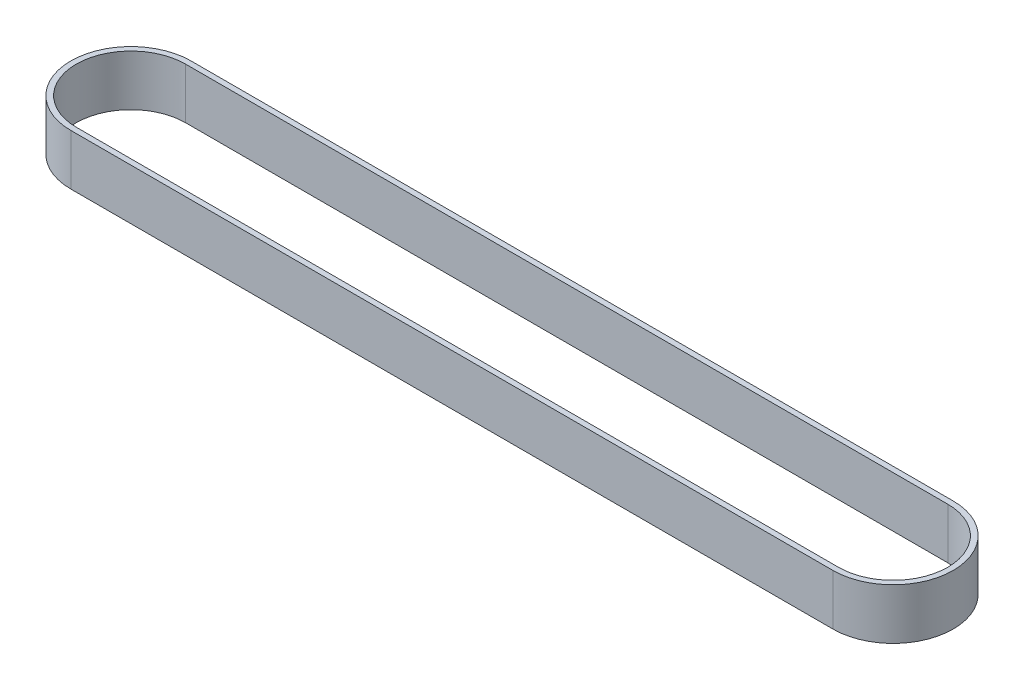
ISO-10303-21;
HEADER;
FILE_DESCRIPTION(('STEP AP214'),'2;1');
FILE_NAME('part.step','',(''),(''),'','','');
FILE_SCHEMA(('AUTOMOTIVE_DESIGN { 1 0 10303 214 1 1 1 1 }'));
ENDSEC;
DATA;
#1=APPLICATION_CONTEXT('core data for automotive mechanical design processes');
#2=APPLICATION_PROTOCOL_DEFINITION('international standard','automotive_design',2000,#1);
#3=PRODUCT_CONTEXT('',#1,'mechanical');
#4=PRODUCT('Part','Part','',(#3));
#5=PRODUCT_RELATED_PRODUCT_CATEGORY('part','',(#4));
#6=PRODUCT_DEFINITION_FORMATION('','',#4);
#7=PRODUCT_DEFINITION_CONTEXT('part definition',#1,'design');
#8=PRODUCT_DEFINITION('design','',#6,#7);
#9=PRODUCT_DEFINITION_SHAPE('','',#8);
#10=(LENGTH_UNIT() NAMED_UNIT(*) SI_UNIT(.MILLI.,.METRE.));
#11=(NAMED_UNIT(*) PLANE_ANGLE_UNIT() SI_UNIT($,.RADIAN.));
#12=(NAMED_UNIT(*) SI_UNIT($,.STERADIAN.) SOLID_ANGLE_UNIT());
#13=UNCERTAINTY_MEASURE_WITH_UNIT(LENGTH_MEASURE(1.E-05),#10,'distance_accuracy_value','');
#14=(GEOMETRIC_REPRESENTATION_CONTEXT(3) GLOBAL_UNCERTAINTY_ASSIGNED_CONTEXT((#13)) GLOBAL_UNIT_ASSIGNED_CONTEXT((#10,
#11,#12)) REPRESENTATION_CONTEXT('',''));
#15=CARTESIAN_POINT('',(0.,0.,0.));
#16=DIRECTION('',(0.,0.,1.));
#17=DIRECTION('',(1.,0.,0.));
#18=AXIS2_PLACEMENT_3D('',#15,#16,#17);
#19=CARTESIAN_POINT('',(0.,9.53,0.));
#20=DIRECTION('',(0.,-1.,0.));
#21=DIRECTION('',(0.,0.,-1.));
#22=AXIS2_PLACEMENT_3D('',#19,#20,#21);
#23=CYLINDRICAL_SURFACE('',#22,11.285);
#24=CARTESIAN_POINT('',(0.,0.,0.));
#25=DIRECTION('',(0.,1.,0.));
#26=DIRECTION('',(0.,0.,1.));
#27=AXIS2_PLACEMENT_3D('',#24,#25,#26);
#28=CIRCLE('',#27,11.285);
#29=CARTESIAN_POINT('',(0.,0.,-11.285));
#30=VERTEX_POINT('',#29);
#31=CARTESIAN_POINT('',(0.,0.,11.285));
#32=VERTEX_POINT('',#31);
#33=EDGE_CURVE('E128',#30,#32,#28,.T.);
#34=ORIENTED_EDGE('',*,*,#33,.T.);
#35=DIRECTION('',(0.,-1.,0.));
#36=VECTOR('',#35,1.);
#37=CARTESIAN_POINT('',(0.,9.53,11.285));
#38=LINE('',#37,#36);
#39=CARTESIAN_POINT('',(0.,9.53,11.285));
#40=VERTEX_POINT('',#39);
#41=EDGE_CURVE('E11',#40,#32,#38,.T.);
#42=ORIENTED_EDGE('',*,*,#41,.F.);
#43=CARTESIAN_POINT('',(0.,9.53,0.));
#44=DIRECTION('',(0.,1.,0.));
#45=DIRECTION('',(0.,0.,1.));
#46=AXIS2_PLACEMENT_3D('',#43,#44,#45);
#47=CIRCLE('',#46,11.285);
#48=CARTESIAN_POINT('',(0.,9.53,-11.285));
#49=VERTEX_POINT('',#48);
#50=EDGE_CURVE('E132',#49,#40,#47,.T.);
#51=ORIENTED_EDGE('',*,*,#50,.F.);
#52=DIRECTION('',(0.,-1.,0.));
#53=VECTOR('',#52,1.);
#54=CARTESIAN_POINT('',(0.,9.53,-11.285));
#55=LINE('',#54,#53);
#56=EDGE_CURVE('E142',#49,#30,#55,.T.);
#57=ORIENTED_EDGE('',*,*,#56,.T.);
#58=EDGE_LOOP('',(#34,#42,#51,#57));
#59=FACE_BOUND('',#58,.T.);
#60=ADVANCED_FACE('F31',(#59),#23,.T.);
#61=CARTESIAN_POINT('',(0.,9.53,11.285));
#62=DIRECTION('',(0.,0.,-1.));
#63=DIRECTION('',(-1.,0.,0.));
#64=AXIS2_PLACEMENT_3D('',#61,#62,#63);
#65=PLANE('',#64);
#66=DIRECTION('',(1.,0.,0.));
#67=VECTOR('',#66,1.);
#68=CARTESIAN_POINT('',(0.,0.,11.285));
#69=LINE('',#68,#67);
#70=CARTESIAN_POINT('',(143.,0.,11.285));
#71=VERTEX_POINT('',#70);
#72=EDGE_CURVE('E145',#32,#71,#69,.T.);
#73=ORIENTED_EDGE('',*,*,#72,.T.);
#74=DIRECTION('',(0.,-1.,0.));
#75=VECTOR('',#74,1.);
#76=CARTESIAN_POINT('',(143.,9.53,11.285));
#77=LINE('',#76,#75);
#78=CARTESIAN_POINT('',(143.,9.53,11.285));
#79=VERTEX_POINT('',#78);
#80=EDGE_CURVE('E38',#79,#71,#77,.T.);
#81=ORIENTED_EDGE('',*,*,#80,.F.);
#82=DIRECTION('',(1.,0.,0.));
#83=VECTOR('',#82,1.);
#84=CARTESIAN_POINT('',(0.,9.53,11.285));
#85=LINE('',#84,#83);
#86=EDGE_CURVE('E135',#40,#79,#85,.T.);
#87=ORIENTED_EDGE('',*,*,#86,.F.);
#88=ORIENTED_EDGE('',*,*,#41,.T.);
#89=EDGE_LOOP('',(#73,#81,#87,#88));
#90=FACE_BOUND('',#89,.T.);
#91=ADVANCED_FACE('F173',(#90),#65,.F.);
#92=CARTESIAN_POINT('',(143.,9.53,0.));
#93=DIRECTION('',(0.,-1.,0.));
#94=DIRECTION('',(0.,0.,-1.));
#95=AXIS2_PLACEMENT_3D('',#92,#93,#94);
#96=CYLINDRICAL_SURFACE('',#95,11.285);
#97=CARTESIAN_POINT('',(143.,0.,0.));
#98=DIRECTION('',(0.,1.,0.));
#99=DIRECTION('',(0.,0.,1.));
#100=AXIS2_PLACEMENT_3D('',#97,#98,#99);
#101=CIRCLE('',#100,11.285);
#102=CARTESIAN_POINT('',(143.,0.,-11.285));
#103=VERTEX_POINT('',#102);
#104=EDGE_CURVE('E147',#71,#103,#101,.T.);
#105=ORIENTED_EDGE('',*,*,#104,.T.);
#106=DIRECTION('',(0.,-1.,0.));
#107=VECTOR('',#106,1.);
#108=CARTESIAN_POINT('',(143.,9.53,-11.285));
#109=LINE('',#108,#107);
#110=CARTESIAN_POINT('',(143.,9.53,-11.285));
#111=VERTEX_POINT('',#110);
#112=EDGE_CURVE('E152',#111,#103,#109,.T.);
#113=ORIENTED_EDGE('',*,*,#112,.F.);
#114=CARTESIAN_POINT('',(143.,9.53,0.));
#115=DIRECTION('',(0.,1.,0.));
#116=DIRECTION('',(0.,0.,1.));
#117=AXIS2_PLACEMENT_3D('',#114,#115,#116);
#118=CIRCLE('',#117,11.285);
#119=EDGE_CURVE('E138',#79,#111,#118,.T.);
#120=ORIENTED_EDGE('',*,*,#119,.F.);
#121=ORIENTED_EDGE('',*,*,#80,.T.);
#122=EDGE_LOOP('',(#105,#113,#120,#121));
#123=FACE_BOUND('',#122,.T.);
#124=ADVANCED_FACE('F159',(#123),#96,.T.);
#125=CARTESIAN_POINT('',(0.,9.53,-11.285));
#126=DIRECTION('',(0.,0.,1.));
#127=DIRECTION('',(1.,0.,0.));
#128=AXIS2_PLACEMENT_3D('',#125,#126,#127);
#129=PLANE('',#128);
#130=DIRECTION('',(-1.,0.,0.));
#131=VECTOR('',#130,1.);
#132=CARTESIAN_POINT('',(0.,0.,-11.285));
#133=LINE('',#132,#131);
#134=EDGE_CURVE('E136',#103,#30,#133,.T.);
#135=ORIENTED_EDGE('',*,*,#134,.T.);
#136=ORIENTED_EDGE('',*,*,#56,.F.);
#137=DIRECTION('',(-1.,0.,0.));
#138=VECTOR('',#137,1.);
#139=CARTESIAN_POINT('',(0.,9.53,-11.285));
#140=LINE('',#139,#138);
#141=EDGE_CURVE('E140',#111,#49,#140,.T.);
#142=ORIENTED_EDGE('',*,*,#141,.F.);
#143=ORIENTED_EDGE('',*,*,#112,.T.);
#144=EDGE_LOOP('',(#135,#136,#142,#143));
#145=FACE_BOUND('',#144,.T.);
#146=ADVANCED_FACE('F166',(#145),#129,.F.);
#147=CARTESIAN_POINT('',(0.,9.53,0.));
#148=DIRECTION('',(0.,1.,0.));
#149=DIRECTION('',(0.,0.,1.));
#150=AXIS2_PLACEMENT_3D('',#147,#148,#149);
#151=PLANE('',#150);
#152=CARTESIAN_POINT('',(0.,9.53,0.));
#153=DIRECTION('',(0.,1.,0.));
#154=DIRECTION('',(0.,0.,1.));
#155=AXIS2_PLACEMENT_3D('',#152,#153,#154);
#156=CIRCLE('',#155,10.255);
#157=CARTESIAN_POINT('',(0.,9.53,-10.255));
#158=VERTEX_POINT('',#157);
#159=CARTESIAN_POINT('',(0.,9.53,10.255));
#160=VERTEX_POINT('',#159);
#161=EDGE_CURVE('E45',#158,#160,#156,.T.);
#162=ORIENTED_EDGE('',*,*,#161,.F.);
#163=DIRECTION('',(-1.,0.,0.));
#164=VECTOR('',#163,1.);
#165=CARTESIAN_POINT('',(0.,9.53,-10.255));
#166=LINE('',#165,#164);
#167=CARTESIAN_POINT('',(143.,9.53,-10.255));
#168=VERTEX_POINT('',#167);
#169=EDGE_CURVE('E113',#168,#158,#166,.T.);
#170=ORIENTED_EDGE('',*,*,#169,.F.);
#171=CARTESIAN_POINT('',(143.,9.53,0.));
#172=DIRECTION('',(0.,1.,0.));
#173=DIRECTION('',(0.,0.,1.));
#174=AXIS2_PLACEMENT_3D('',#171,#172,#173);
#175=CIRCLE('',#174,10.255);
#176=CARTESIAN_POINT('',(143.,9.53,10.255));
#177=VERTEX_POINT('',#176);
#178=EDGE_CURVE('E116',#177,#168,#175,.T.);
#179=ORIENTED_EDGE('',*,*,#178,.F.);
#180=DIRECTION('',(1.,0.,0.));
#181=VECTOR('',#180,1.);
#182=CARTESIAN_POINT('',(0.,9.53,10.255));
#183=LINE('',#182,#181);
#184=EDGE_CURVE('E122',#160,#177,#183,.T.);
#185=ORIENTED_EDGE('',*,*,#184,.F.);
#186=EDGE_LOOP('',(#162,#170,#179,#185));
#187=FACE_BOUND('',#186,.T.);
#188=ORIENTED_EDGE('',*,*,#50,.T.);
#189=ORIENTED_EDGE('',*,*,#86,.T.);
#190=ORIENTED_EDGE('',*,*,#119,.T.);
#191=ORIENTED_EDGE('',*,*,#141,.T.);
#192=EDGE_LOOP('',(#188,#189,#190,#191));
#193=FACE_BOUND('',#192,.T.);
#194=ADVANCED_FACE('F172',(#187,#193),#151,.T.);
#195=CARTESIAN_POINT('',(0.,0.,0.));
#196=DIRECTION('',(0.,1.,0.));
#197=DIRECTION('',(0.,0.,1.));
#198=AXIS2_PLACEMENT_3D('',#195,#196,#197);
#199=PLANE('',#198);
#200=DIRECTION('',(-1.,0.,0.));
#201=VECTOR('',#200,1.);
#202=CARTESIAN_POINT('',(0.,0.,-10.255));
#203=LINE('',#202,#201);
#204=CARTESIAN_POINT('',(143.,0.,-10.255));
#205=VERTEX_POINT('',#204);
#206=CARTESIAN_POINT('',(0.,0.,-10.255));
#207=VERTEX_POINT('',#206);
#208=EDGE_CURVE('E103',#205,#207,#203,.T.);
#209=ORIENTED_EDGE('',*,*,#208,.T.);
#210=CARTESIAN_POINT('',(0.,0.,0.));
#211=DIRECTION('',(0.,1.,0.));
#212=DIRECTION('',(0.,0.,1.));
#213=AXIS2_PLACEMENT_3D('',#210,#211,#212);
#214=CIRCLE('',#213,10.255);
#215=CARTESIAN_POINT('',(0.,0.,10.255));
#216=VERTEX_POINT('',#215);
#217=EDGE_CURVE('E97',#207,#216,#214,.T.);
#218=ORIENTED_EDGE('',*,*,#217,.T.);
#219=DIRECTION('',(1.,0.,0.));
#220=VECTOR('',#219,1.);
#221=CARTESIAN_POINT('',(0.,0.,10.255));
#222=LINE('',#221,#220);
#223=CARTESIAN_POINT('',(143.,0.,10.255));
#224=VERTEX_POINT('',#223);
#225=EDGE_CURVE('E106',#216,#224,#222,.T.);
#226=ORIENTED_EDGE('',*,*,#225,.T.);
#227=CARTESIAN_POINT('',(143.,0.,0.));
#228=DIRECTION('',(0.,1.,0.));
#229=DIRECTION('',(0.,0.,1.));
#230=AXIS2_PLACEMENT_3D('',#227,#228,#229);
#231=CIRCLE('',#230,10.255);
#232=EDGE_CURVE('E53',#224,#205,#231,.T.);
#233=ORIENTED_EDGE('',*,*,#232,.T.);
#234=EDGE_LOOP('',(#209,#218,#226,#233));
#235=FACE_BOUND('',#234,.T.);
#236=ORIENTED_EDGE('',*,*,#33,.F.);
#237=ORIENTED_EDGE('',*,*,#134,.F.);
#238=ORIENTED_EDGE('',*,*,#104,.F.);
#239=ORIENTED_EDGE('',*,*,#72,.F.);
#240=EDGE_LOOP('',(#236,#237,#238,#239));
#241=FACE_BOUND('',#240,.T.);
#242=ADVANCED_FACE('F110',(#235,#241),#199,.F.);
#243=CARTESIAN_POINT('',(0.,0.,0.));
#244=DIRECTION('',(0.,1.,0.));
#245=DIRECTION('',(0.,0.,1.));
#246=AXIS2_PLACEMENT_3D('',#243,#244,#245);
#247=CYLINDRICAL_SURFACE('',#246,10.255);
#248=ORIENTED_EDGE('',*,*,#161,.T.);
#249=DIRECTION('',(0.,1.,0.));
#250=VECTOR('',#249,1.);
#251=CARTESIAN_POINT('',(0.,0.,10.255));
#252=LINE('',#251,#250);
#253=EDGE_CURVE('E93',#216,#160,#252,.T.);
#254=ORIENTED_EDGE('',*,*,#253,.F.);
#255=ORIENTED_EDGE('',*,*,#217,.F.);
#256=DIRECTION('',(0.,1.,0.));
#257=VECTOR('',#256,1.);
#258=CARTESIAN_POINT('',(0.,0.,-10.255));
#259=LINE('',#258,#257);
#260=EDGE_CURVE('E126',#207,#158,#259,.T.);
#261=ORIENTED_EDGE('',*,*,#260,.T.);
#262=EDGE_LOOP('',(#248,#254,#255,#261));
#263=FACE_BOUND('',#262,.T.);
#264=ADVANCED_FACE('F95',(#263),#247,.F.);
#265=CARTESIAN_POINT('',(0.,0.,-10.255));
#266=DIRECTION('',(0.,0.,-1.));
#267=DIRECTION('',(-1.,0.,0.));
#268=AXIS2_PLACEMENT_3D('',#265,#266,#267);
#269=PLANE('',#268);
#270=ORIENTED_EDGE('',*,*,#169,.T.);
#271=ORIENTED_EDGE('',*,*,#260,.F.);
#272=ORIENTED_EDGE('',*,*,#208,.F.);
#273=DIRECTION('',(0.,1.,0.));
#274=VECTOR('',#273,1.);
#275=CARTESIAN_POINT('',(143.,0.,-10.255));
#276=LINE('',#275,#274);
#277=EDGE_CURVE('E129',#205,#168,#276,.T.);
#278=ORIENTED_EDGE('',*,*,#277,.T.);
#279=EDGE_LOOP('',(#270,#271,#272,#278));
#280=FACE_BOUND('',#279,.T.);
#281=ADVANCED_FACE('F190',(#280),#269,.F.);
#282=CARTESIAN_POINT('',(143.,0.,0.));
#283=DIRECTION('',(0.,1.,0.));
#284=DIRECTION('',(0.,0.,1.));
#285=AXIS2_PLACEMENT_3D('',#282,#283,#284);
#286=CYLINDRICAL_SURFACE('',#285,10.255);
#287=ORIENTED_EDGE('',*,*,#178,.T.);
#288=ORIENTED_EDGE('',*,*,#277,.F.);
#289=ORIENTED_EDGE('',*,*,#232,.F.);
#290=DIRECTION('',(0.,1.,0.));
#291=VECTOR('',#290,1.);
#292=CARTESIAN_POINT('',(143.,0.,10.255));
#293=LINE('',#292,#291);
#294=EDGE_CURVE('E102',#224,#177,#293,.T.);
#295=ORIENTED_EDGE('',*,*,#294,.T.);
#296=EDGE_LOOP('',(#287,#288,#289,#295));
#297=FACE_BOUND('',#296,.T.);
#298=ADVANCED_FACE('F193',(#297),#286,.F.);
#299=CARTESIAN_POINT('',(0.,0.,10.255));
#300=DIRECTION('',(0.,0.,1.));
#301=DIRECTION('',(1.,0.,0.));
#302=AXIS2_PLACEMENT_3D('',#299,#300,#301);
#303=PLANE('',#302);
#304=ORIENTED_EDGE('',*,*,#184,.T.);
#305=ORIENTED_EDGE('',*,*,#294,.F.);
#306=ORIENTED_EDGE('',*,*,#225,.F.);
#307=ORIENTED_EDGE('',*,*,#253,.T.);
#308=EDGE_LOOP('',(#304,#305,#306,#307));
#309=FACE_BOUND('',#308,.T.);
#310=ADVANCED_FACE('F107',(#309),#303,.F.);
#311=CLOSED_SHELL('',(#60,#91,#124,#146,#194,#242,#264,#281,#298,#310));
#312=MANIFOLD_SOLID_BREP('B2',#311);
#313=ADVANCED_BREP_SHAPE_REPRESENTATION('',(#18,#312),#14);
#314=SHAPE_DEFINITION_REPRESENTATION(#9,#313);
ENDSEC;
END-ISO-10303-21;
